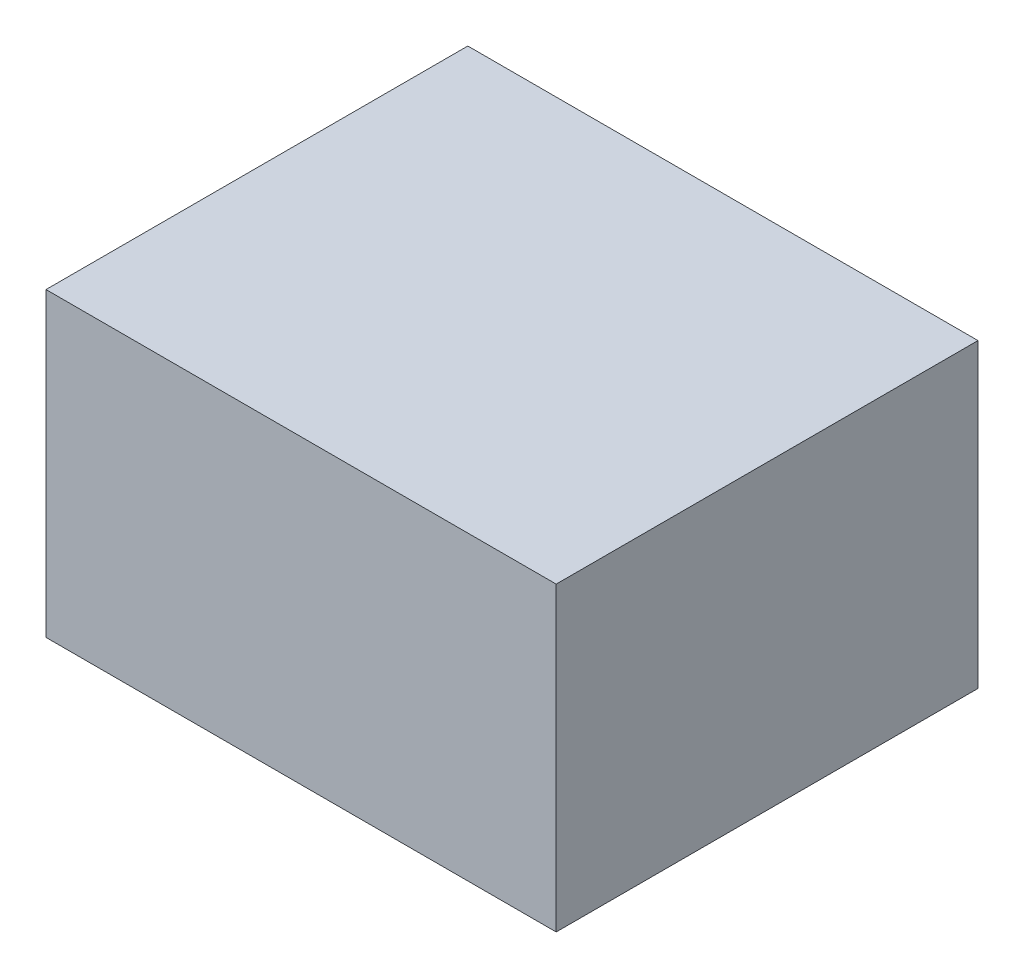
ISO-10303-21;
HEADER;
FILE_DESCRIPTION(('STEP AP214'),'2;1');
FILE_NAME('part.step','',(''),(''),'','','');
FILE_SCHEMA(('AUTOMOTIVE_DESIGN { 1 0 10303 214 1 1 1 1 }'));
ENDSEC;
DATA;
#1=APPLICATION_CONTEXT('core data for automotive mechanical design processes');
#2=APPLICATION_PROTOCOL_DEFINITION('international standard','automotive_design',2000,#1);
#3=PRODUCT_CONTEXT('',#1,'mechanical');
#4=PRODUCT('Part','Part','',(#3));
#5=PRODUCT_RELATED_PRODUCT_CATEGORY('part','',(#4));
#6=PRODUCT_DEFINITION_FORMATION('','',#4);
#7=PRODUCT_DEFINITION_CONTEXT('part definition',#1,'design');
#8=PRODUCT_DEFINITION('design','',#6,#7);
#9=PRODUCT_DEFINITION_SHAPE('','',#8);
#10=(LENGTH_UNIT() NAMED_UNIT(*) SI_UNIT(.MILLI.,.METRE.));
#11=(NAMED_UNIT(*) PLANE_ANGLE_UNIT() SI_UNIT($,.RADIAN.));
#12=(NAMED_UNIT(*) SI_UNIT($,.STERADIAN.) SOLID_ANGLE_UNIT());
#13=UNCERTAINTY_MEASURE_WITH_UNIT(LENGTH_MEASURE(1.E-05),#10,'distance_accuracy_value','');
#14=(GEOMETRIC_REPRESENTATION_CONTEXT(3) GLOBAL_UNCERTAINTY_ASSIGNED_CONTEXT((#13)) GLOBAL_UNIT_ASSIGNED_CONTEXT((#10,
#11,#12)) REPRESENTATION_CONTEXT('',''));
#15=CARTESIAN_POINT('',(0.,0.,0.));
#16=DIRECTION('',(0.,0.,1.));
#17=DIRECTION('',(1.,0.,0.));
#18=AXIS2_PLACEMENT_3D('',#15,#16,#17);
#19=CARTESIAN_POINT('',(1.27,0.75000104,2.10000088));
#20=DIRECTION('',(0.,0.,1.));
#21=DIRECTION('',(1.,0.,0.));
#22=AXIS2_PLACEMENT_3D('',#19,#20,#21);
#23=PLANE('',#22);
#24=DIRECTION('',(1.,0.,0.));
#25=VECTOR('',#24,1.);
#26=CARTESIAN_POINT('',(-1.27,0.75000104,2.10000088));
#27=LINE('',#26,#25);
#28=CARTESIAN_POINT('',(-1.27,0.75000104,2.10000088));
#29=VERTEX_POINT('',#28);
#30=CARTESIAN_POINT('',(1.27,0.75000104,2.10000088));
#31=VERTEX_POINT('',#30);
#32=EDGE_CURVE('E20',#29,#31,#27,.T.);
#33=ORIENTED_EDGE('',*,*,#32,.F.);
#34=DIRECTION('',(0.,1.,0.));
#35=VECTOR('',#34,1.);
#36=CARTESIAN_POINT('',(-1.27,-0.7499985,2.10000088));
#37=LINE('',#36,#35);
#38=CARTESIAN_POINT('',(-1.27,-0.7499985,2.10000088));
#39=VERTEX_POINT('',#38);
#40=EDGE_CURVE('E98',#39,#29,#37,.T.);
#41=ORIENTED_EDGE('',*,*,#40,.F.);
#42=DIRECTION('',(-1.,0.,0.));
#43=VECTOR('',#42,1.);
#44=CARTESIAN_POINT('',(1.27,-0.7499985,2.10000088));
#45=LINE('',#44,#43);
#46=CARTESIAN_POINT('',(1.27,-0.7499985,2.10000088));
#47=VERTEX_POINT('',#46);
#48=EDGE_CURVE('E84',#47,#39,#45,.T.);
#49=ORIENTED_EDGE('',*,*,#48,.F.);
#50=DIRECTION('',(0.,-1.,0.));
#51=VECTOR('',#50,1.);
#52=CARTESIAN_POINT('',(1.27,0.75000104,2.10000088));
#53=LINE('',#52,#51);
#54=EDGE_CURVE('E88',#31,#47,#53,.T.);
#55=ORIENTED_EDGE('',*,*,#54,.F.);
#56=EDGE_LOOP('',(#33,#41,#49,#55));
#57=FACE_BOUND('',#56,.T.);
#58=ADVANCED_FACE('F17',(#57),#23,.T.);
#59=CARTESIAN_POINT('',(1.27,0.75000104,0.));
#60=DIRECTION('',(0.,0.,1.));
#61=DIRECTION('',(1.,0.,0.));
#62=AXIS2_PLACEMENT_3D('',#59,#60,#61);
#63=PLANE('',#62);
#64=DIRECTION('',(0.,-1.,0.));
#65=VECTOR('',#64,1.);
#66=CARTESIAN_POINT('',(1.27,0.75000104,0.));
#67=LINE('',#66,#65);
#68=CARTESIAN_POINT('',(1.27,0.75000104,0.));
#69=VERTEX_POINT('',#68);
#70=CARTESIAN_POINT('',(1.27,-0.7499985,0.));
#71=VERTEX_POINT('',#70);
#72=EDGE_CURVE('E72',#69,#71,#67,.T.);
#73=ORIENTED_EDGE('',*,*,#72,.T.);
#74=DIRECTION('',(-1.,0.,0.));
#75=VECTOR('',#74,1.);
#76=CARTESIAN_POINT('',(1.27,-0.7499985,0.));
#77=LINE('',#76,#75);
#78=CARTESIAN_POINT('',(-1.27,-0.7499985,0.));
#79=VERTEX_POINT('',#78);
#80=EDGE_CURVE('E103',#71,#79,#77,.T.);
#81=ORIENTED_EDGE('',*,*,#80,.T.);
#82=DIRECTION('',(0.,1.,0.));
#83=VECTOR('',#82,1.);
#84=CARTESIAN_POINT('',(-1.27,-0.7499985,0.));
#85=LINE('',#84,#83);
#86=CARTESIAN_POINT('',(-1.27,0.75000104,0.));
#87=VERTEX_POINT('',#86);
#88=EDGE_CURVE('E74',#79,#87,#85,.T.);
#89=ORIENTED_EDGE('',*,*,#88,.T.);
#90=DIRECTION('',(1.,0.,0.));
#91=VECTOR('',#90,1.);
#92=CARTESIAN_POINT('',(-1.27,0.75000104,0.));
#93=LINE('',#92,#91);
#94=EDGE_CURVE('E11',#87,#69,#93,.T.);
#95=ORIENTED_EDGE('',*,*,#94,.T.);
#96=EDGE_LOOP('',(#73,#81,#89,#95));
#97=FACE_BOUND('',#96,.T.);
#98=ADVANCED_FACE('F70',(#97),#63,.F.);
#99=CARTESIAN_POINT('',(-1.27,0.75000104,0.));
#100=DIRECTION('',(0.,1.,0.));
#101=DIRECTION('',(1.,0.,0.));
#102=AXIS2_PLACEMENT_3D('',#99,#100,#101);
#103=PLANE('',#102);
#104=DIRECTION('',(0.,0.,1.));
#105=VECTOR('',#104,1.);
#106=CARTESIAN_POINT('',(-1.27,0.75000104,0.));
#107=LINE('',#106,#105);
#108=EDGE_CURVE('E96',#87,#29,#107,.T.);
#109=ORIENTED_EDGE('',*,*,#108,.T.);
#110=ORIENTED_EDGE('',*,*,#32,.T.);
#111=DIRECTION('',(0.,0.,1.));
#112=VECTOR('',#111,1.);
#113=CARTESIAN_POINT('',(1.27,0.75000104,0.));
#114=LINE('',#113,#112);
#115=EDGE_CURVE('E80',#69,#31,#114,.T.);
#116=ORIENTED_EDGE('',*,*,#115,.F.);
#117=ORIENTED_EDGE('',*,*,#94,.F.);
#118=EDGE_LOOP('',(#109,#110,#116,#117));
#119=FACE_BOUND('',#118,.T.);
#120=ADVANCED_FACE('F86',(#119),#103,.T.);
#121=CARTESIAN_POINT('',(-1.27,-0.7499985,0.));
#122=DIRECTION('',(-1.,0.,0.));
#123=DIRECTION('',(0.,0.,1.));
#124=AXIS2_PLACEMENT_3D('',#121,#122,#123);
#125=PLANE('',#124);
#126=DIRECTION('',(0.,0.,1.));
#127=VECTOR('',#126,1.);
#128=CARTESIAN_POINT('',(-1.27,-0.7499985,0.));
#129=LINE('',#128,#127);
#130=EDGE_CURVE('E109',#79,#39,#129,.T.);
#131=ORIENTED_EDGE('',*,*,#130,.T.);
#132=ORIENTED_EDGE('',*,*,#40,.T.);
#133=ORIENTED_EDGE('',*,*,#108,.F.);
#134=ORIENTED_EDGE('',*,*,#88,.F.);
#135=EDGE_LOOP('',(#131,#132,#133,#134));
#136=FACE_BOUND('',#135,.T.);
#137=ADVANCED_FACE('F144',(#136),#125,.T.);
#138=CARTESIAN_POINT('',(1.27,-0.7499985,0.));
#139=DIRECTION('',(0.,-1.,0.));
#140=DIRECTION('',(0.,0.,-1.));
#141=AXIS2_PLACEMENT_3D('',#138,#139,#140);
#142=PLANE('',#141);
#143=DIRECTION('',(0.,0.,1.));
#144=VECTOR('',#143,1.);
#145=CARTESIAN_POINT('',(1.27,-0.7499985,0.));
#146=LINE('',#145,#144);
#147=EDGE_CURVE('E82',#71,#47,#146,.T.);
#148=ORIENTED_EDGE('',*,*,#147,.T.);
#149=ORIENTED_EDGE('',*,*,#48,.T.);
#150=ORIENTED_EDGE('',*,*,#130,.F.);
#151=ORIENTED_EDGE('',*,*,#80,.F.);
#152=EDGE_LOOP('',(#148,#149,#150,#151));
#153=FACE_BOUND('',#152,.T.);
#154=ADVANCED_FACE('F133',(#153),#142,.T.);
#155=CARTESIAN_POINT('',(1.27,0.75000104,0.));
#156=DIRECTION('',(1.,0.,0.));
#157=DIRECTION('',(0.,1.,0.));
#158=AXIS2_PLACEMENT_3D('',#155,#156,#157);
#159=PLANE('',#158);
#160=ORIENTED_EDGE('',*,*,#115,.T.);
#161=ORIENTED_EDGE('',*,*,#54,.T.);
#162=ORIENTED_EDGE('',*,*,#147,.F.);
#163=ORIENTED_EDGE('',*,*,#72,.F.);
#164=EDGE_LOOP('',(#160,#161,#162,#163));
#165=FACE_BOUND('',#164,.T.);
#166=ADVANCED_FACE('F78',(#165),#159,.T.);
#167=CLOSED_SHELL('',(#58,#98,#120,#137,#154,#166));
#168=MANIFOLD_SOLID_BREP('B1',#167);
#169=ADVANCED_BREP_SHAPE_REPRESENTATION('',(#18,#168),#14);
#170=SHAPE_DEFINITION_REPRESENTATION(#9,#169);
ENDSEC;
END-ISO-10303-21;
